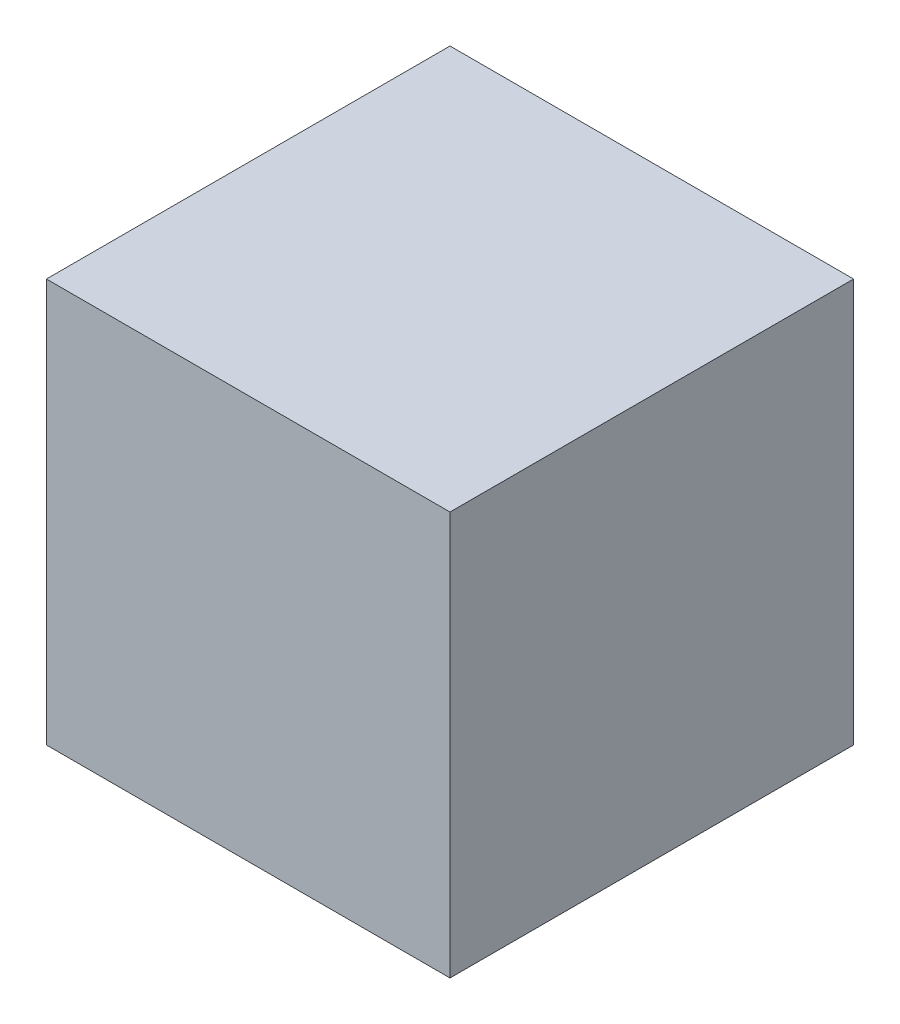
ISO-10303-21;
HEADER;
FILE_DESCRIPTION(('STEP AP214'),'2;1');
FILE_NAME('part.step','',(''),(''),'','','');
FILE_SCHEMA(('AUTOMOTIVE_DESIGN { 1 0 10303 214 1 1 1 1 }'));
ENDSEC;
DATA;
#1=APPLICATION_CONTEXT('core data for automotive mechanical design processes');
#2=APPLICATION_PROTOCOL_DEFINITION('international standard','automotive_design',2000,#1);
#3=PRODUCT_CONTEXT('',#1,'mechanical');
#4=PRODUCT('Part','Part','',(#3));
#5=PRODUCT_RELATED_PRODUCT_CATEGORY('part','',(#4));
#6=PRODUCT_DEFINITION_FORMATION('','',#4);
#7=PRODUCT_DEFINITION_CONTEXT('part definition',#1,'design');
#8=PRODUCT_DEFINITION('design','',#6,#7);
#9=PRODUCT_DEFINITION_SHAPE('','',#8);
#10=(LENGTH_UNIT() NAMED_UNIT(*) SI_UNIT(.MILLI.,.METRE.));
#11=(NAMED_UNIT(*) PLANE_ANGLE_UNIT() SI_UNIT($,.RADIAN.));
#12=(NAMED_UNIT(*) SI_UNIT($,.STERADIAN.) SOLID_ANGLE_UNIT());
#13=UNCERTAINTY_MEASURE_WITH_UNIT(LENGTH_MEASURE(1.E-05),#10,'distance_accuracy_value','');
#14=(GEOMETRIC_REPRESENTATION_CONTEXT(3) GLOBAL_UNCERTAINTY_ASSIGNED_CONTEXT((#13)) GLOBAL_UNIT_ASSIGNED_CONTEXT((#10,
#11,#12)) REPRESENTATION_CONTEXT('',''));
#15=CARTESIAN_POINT('',(0.,0.,0.));
#16=DIRECTION('',(0.,0.,1.));
#17=DIRECTION('',(1.,0.,0.));
#18=AXIS2_PLACEMENT_3D('',#15,#16,#17);
#19=CARTESIAN_POINT('',(-250.,-250.,500.));
#20=DIRECTION('',(1.,0.,0.));
#21=DIRECTION('',(0.,0.,-1.));
#22=AXIS2_PLACEMENT_3D('',#19,#20,#21);
#23=PLANE('',#22);
#24=DIRECTION('',(0.,-1.,0.));
#25=VECTOR('',#24,1.);
#26=CARTESIAN_POINT('',(-250.,-250.,0.));
#27=LINE('',#26,#25);
#28=CARTESIAN_POINT('',(-250.,250.,0.));
#29=VERTEX_POINT('',#28);
#30=CARTESIAN_POINT('',(-250.,-250.,0.));
#31=VERTEX_POINT('',#30);
#32=EDGE_CURVE('E101',#29,#31,#27,.T.);
#33=ORIENTED_EDGE('',*,*,#32,.T.);
#34=DIRECTION('',(0.,0.,-1.));
#35=VECTOR('',#34,1.);
#36=CARTESIAN_POINT('',(-250.,-250.,500.));
#37=LINE('',#36,#35);
#38=CARTESIAN_POINT('',(-250.,-250.,500.));
#39=VERTEX_POINT('',#38);
#40=EDGE_CURVE('E11',#39,#31,#37,.T.);
#41=ORIENTED_EDGE('',*,*,#40,.F.);
#42=DIRECTION('',(0.,-1.,0.));
#43=VECTOR('',#42,1.);
#44=CARTESIAN_POINT('',(-250.,-250.,500.));
#45=LINE('',#44,#43);
#46=CARTESIAN_POINT('',(-250.,250.,500.));
#47=VERTEX_POINT('',#46);
#48=EDGE_CURVE('E89',#47,#39,#45,.T.);
#49=ORIENTED_EDGE('',*,*,#48,.F.);
#50=DIRECTION('',(0.,0.,-1.));
#51=VECTOR('',#50,1.);
#52=CARTESIAN_POINT('',(-250.,250.,500.));
#53=LINE('',#52,#51);
#54=EDGE_CURVE('E97',#47,#29,#53,.T.);
#55=ORIENTED_EDGE('',*,*,#54,.T.);
#56=EDGE_LOOP('',(#33,#41,#49,#55));
#57=FACE_BOUND('',#56,.T.);
#58=ADVANCED_FACE('F38',(#57),#23,.F.);
#59=CARTESIAN_POINT('',(250.,-250.,500.));
#60=DIRECTION('',(0.,1.,0.));
#61=DIRECTION('',(0.,0.,1.));
#62=AXIS2_PLACEMENT_3D('',#59,#60,#61);
#63=PLANE('',#62);
#64=DIRECTION('',(1.,0.,0.));
#65=VECTOR('',#64,1.);
#66=CARTESIAN_POINT('',(250.,-250.,0.));
#67=LINE('',#66,#65);
#68=CARTESIAN_POINT('',(250.,-250.,0.));
#69=VERTEX_POINT('',#68);
#70=EDGE_CURVE('E93',#31,#69,#67,.T.);
#71=ORIENTED_EDGE('',*,*,#70,.T.);
#72=DIRECTION('',(0.,0.,-1.));
#73=VECTOR('',#72,1.);
#74=CARTESIAN_POINT('',(250.,-250.,500.));
#75=LINE('',#74,#73);
#76=CARTESIAN_POINT('',(250.,-250.,500.));
#77=VERTEX_POINT('',#76);
#78=EDGE_CURVE('E46',#77,#69,#75,.T.);
#79=ORIENTED_EDGE('',*,*,#78,.F.);
#80=DIRECTION('',(1.,0.,0.));
#81=VECTOR('',#80,1.);
#82=CARTESIAN_POINT('',(250.,-250.,500.));
#83=LINE('',#82,#81);
#84=EDGE_CURVE('E84',#39,#77,#83,.T.);
#85=ORIENTED_EDGE('',*,*,#84,.F.);
#86=ORIENTED_EDGE('',*,*,#40,.T.);
#87=EDGE_LOOP('',(#71,#79,#85,#86));
#88=FACE_BOUND('',#87,.T.);
#89=ADVANCED_FACE('F92',(#88),#63,.F.);
#90=CARTESIAN_POINT('',(250.,-250.,500.));
#91=DIRECTION('',(-1.,0.,0.));
#92=DIRECTION('',(0.,0.,1.));
#93=AXIS2_PLACEMENT_3D('',#90,#91,#92);
#94=PLANE('',#93);
#95=DIRECTION('',(0.,1.,0.));
#96=VECTOR('',#95,1.);
#97=CARTESIAN_POINT('',(250.,-250.,0.));
#98=LINE('',#97,#96);
#99=CARTESIAN_POINT('',(250.,250.,0.));
#100=VERTEX_POINT('',#99);
#101=EDGE_CURVE('E71',#69,#100,#98,.T.);
#102=ORIENTED_EDGE('',*,*,#101,.T.);
#103=DIRECTION('',(0.,0.,-1.));
#104=VECTOR('',#103,1.);
#105=CARTESIAN_POINT('',(250.,250.,500.));
#106=LINE('',#105,#104);
#107=CARTESIAN_POINT('',(250.,250.,500.));
#108=VERTEX_POINT('',#107);
#109=EDGE_CURVE('E94',#108,#100,#106,.T.);
#110=ORIENTED_EDGE('',*,*,#109,.F.);
#111=DIRECTION('',(0.,1.,0.));
#112=VECTOR('',#111,1.);
#113=CARTESIAN_POINT('',(250.,-250.,500.));
#114=LINE('',#113,#112);
#115=EDGE_CURVE('E87',#77,#108,#114,.T.);
#116=ORIENTED_EDGE('',*,*,#115,.F.);
#117=ORIENTED_EDGE('',*,*,#78,.T.);
#118=EDGE_LOOP('',(#102,#110,#116,#117));
#119=FACE_BOUND('',#118,.T.);
#120=ADVANCED_FACE('F95',(#119),#94,.F.);
#121=CARTESIAN_POINT('',(250.,250.,500.));
#122=DIRECTION('',(0.,-1.,0.));
#123=DIRECTION('',(1.,0.,0.));
#124=AXIS2_PLACEMENT_3D('',#121,#122,#123);
#125=PLANE('',#124);
#126=DIRECTION('',(-1.,0.,0.));
#127=VECTOR('',#126,1.);
#128=CARTESIAN_POINT('',(250.,250.,0.));
#129=LINE('',#128,#127);
#130=EDGE_CURVE('E77',#100,#29,#129,.T.);
#131=ORIENTED_EDGE('',*,*,#130,.T.);
#132=ORIENTED_EDGE('',*,*,#54,.F.);
#133=DIRECTION('',(-1.,0.,0.));
#134=VECTOR('',#133,1.);
#135=CARTESIAN_POINT('',(250.,250.,500.));
#136=LINE('',#135,#134);
#137=EDGE_CURVE('E54',#108,#47,#136,.T.);
#138=ORIENTED_EDGE('',*,*,#137,.F.);
#139=ORIENTED_EDGE('',*,*,#109,.T.);
#140=EDGE_LOOP('',(#131,#132,#138,#139));
#141=FACE_BOUND('',#140,.T.);
#142=ADVANCED_FACE('F108',(#141),#125,.F.);
#143=CARTESIAN_POINT('',(0.,0.,500.));
#144=DIRECTION('',(0.,0.,1.));
#145=DIRECTION('',(1.,0.,0.));
#146=AXIS2_PLACEMENT_3D('',#143,#144,#145);
#147=PLANE('',#146);
#148=ORIENTED_EDGE('',*,*,#48,.T.);
#149=ORIENTED_EDGE('',*,*,#84,.T.);
#150=ORIENTED_EDGE('',*,*,#115,.T.);
#151=ORIENTED_EDGE('',*,*,#137,.T.);
#152=EDGE_LOOP('',(#148,#149,#150,#151));
#153=FACE_BOUND('',#152,.T.);
#154=ADVANCED_FACE('F85',(#153),#147,.T.);
#155=CARTESIAN_POINT('',(0.,0.,0.));
#156=DIRECTION('',(0.,0.,1.));
#157=DIRECTION('',(1.,0.,0.));
#158=AXIS2_PLACEMENT_3D('',#155,#156,#157);
#159=PLANE('',#158);
#160=ORIENTED_EDGE('',*,*,#32,.F.);
#161=ORIENTED_EDGE('',*,*,#130,.F.);
#162=ORIENTED_EDGE('',*,*,#101,.F.);
#163=ORIENTED_EDGE('',*,*,#70,.F.);
#164=EDGE_LOOP('',(#160,#161,#162,#163));
#165=FACE_BOUND('',#164,.T.);
#166=ADVANCED_FACE('F111',(#165),#159,.F.);
#167=CLOSED_SHELL('',(#58,#89,#120,#142,#154,#166));
#168=MANIFOLD_SOLID_BREP('B2',#167);
#169=ADVANCED_BREP_SHAPE_REPRESENTATION('',(#18,#168),#14);
#170=SHAPE_DEFINITION_REPRESENTATION(#9,#169);
ENDSEC;
END-ISO-10303-21;
